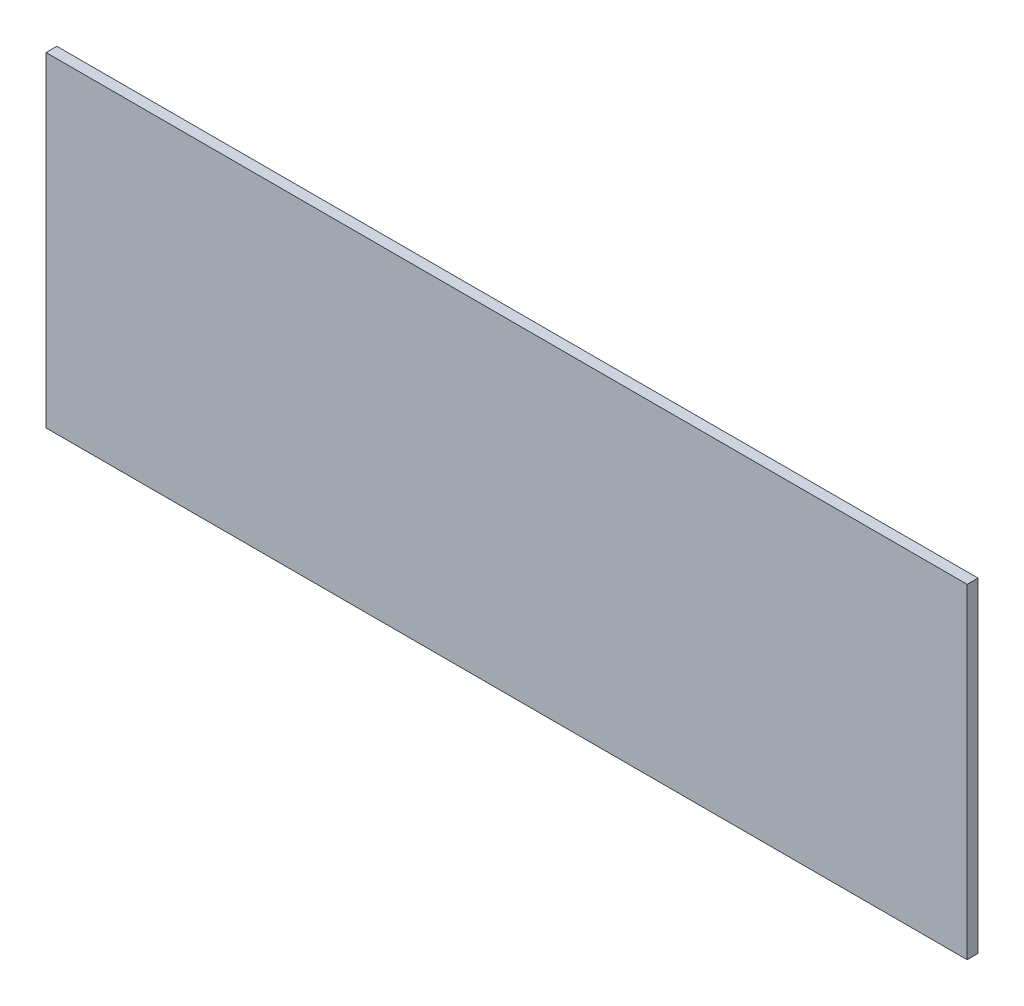
ISO-10303-21;
HEADER;
FILE_DESCRIPTION(('STEP AP214'),'2;1');
FILE_NAME('part.step','',(''),(''),'','','');
FILE_SCHEMA(('AUTOMOTIVE_DESIGN { 1 0 10303 214 1 1 1 1 }'));
ENDSEC;
DATA;
#1=APPLICATION_CONTEXT('core data for automotive mechanical design processes');
#2=APPLICATION_PROTOCOL_DEFINITION('international standard','automotive_design',2000,#1);
#3=PRODUCT_CONTEXT('',#1,'mechanical');
#4=PRODUCT('Part','Part','',(#3));
#5=PRODUCT_RELATED_PRODUCT_CATEGORY('part','',(#4));
#6=PRODUCT_DEFINITION_FORMATION('','',#4);
#7=PRODUCT_DEFINITION_CONTEXT('part definition',#1,'design');
#8=PRODUCT_DEFINITION('design','',#6,#7);
#9=PRODUCT_DEFINITION_SHAPE('','',#8);
#10=(LENGTH_UNIT() NAMED_UNIT(*) SI_UNIT(.MILLI.,.METRE.));
#11=(NAMED_UNIT(*) PLANE_ANGLE_UNIT() SI_UNIT($,.RADIAN.));
#12=(NAMED_UNIT(*) SI_UNIT($,.STERADIAN.) SOLID_ANGLE_UNIT());
#13=UNCERTAINTY_MEASURE_WITH_UNIT(LENGTH_MEASURE(1.E-05),#10,'distance_accuracy_value','');
#14=(GEOMETRIC_REPRESENTATION_CONTEXT(3) GLOBAL_UNCERTAINTY_ASSIGNED_CONTEXT((#13)) GLOBAL_UNIT_ASSIGNED_CONTEXT((#10,
#11,#12)) REPRESENTATION_CONTEXT('',''));
#15=CARTESIAN_POINT('',(0.,0.,0.));
#16=DIRECTION('',(0.,0.,1.));
#17=DIRECTION('',(1.,0.,0.));
#18=AXIS2_PLACEMENT_3D('',#15,#16,#17);
#19=CARTESIAN_POINT('',(-425.,-150.,10.));
#20=DIRECTION('',(1.,0.,0.));
#21=DIRECTION('',(0.,0.,-1.));
#22=AXIS2_PLACEMENT_3D('',#19,#20,#21);
#23=PLANE('',#22);
#24=DIRECTION('',(0.,-1.,0.));
#25=VECTOR('',#24,1.);
#26=CARTESIAN_POINT('',(-425.,-150.,0.));
#27=LINE('',#26,#25);
#28=CARTESIAN_POINT('',(-425.,150.,0.));
#29=VERTEX_POINT('',#28);
#30=CARTESIAN_POINT('',(-425.,-150.,0.));
#31=VERTEX_POINT('',#30);
#32=EDGE_CURVE('E96',#29,#31,#27,.T.);
#33=ORIENTED_EDGE('',*,*,#32,.T.);
#34=DIRECTION('',(0.,0.,-1.));
#35=VECTOR('',#34,1.);
#36=CARTESIAN_POINT('',(-425.,-150.,10.));
#37=LINE('',#36,#35);
#38=CARTESIAN_POINT('',(-425.,-150.,10.));
#39=VERTEX_POINT('',#38);
#40=EDGE_CURVE('E11',#39,#31,#37,.T.);
#41=ORIENTED_EDGE('',*,*,#40,.F.);
#42=DIRECTION('',(0.,-1.,0.));
#43=VECTOR('',#42,1.);
#44=CARTESIAN_POINT('',(-425.,-150.,10.));
#45=LINE('',#44,#43);
#46=CARTESIAN_POINT('',(-425.,150.,10.));
#47=VERTEX_POINT('',#46);
#48=EDGE_CURVE('E84',#47,#39,#45,.T.);
#49=ORIENTED_EDGE('',*,*,#48,.F.);
#50=DIRECTION('',(0.,0.,-1.));
#51=VECTOR('',#50,1.);
#52=CARTESIAN_POINT('',(-425.,150.,10.));
#53=LINE('',#52,#51);
#54=EDGE_CURVE('E92',#47,#29,#53,.T.);
#55=ORIENTED_EDGE('',*,*,#54,.T.);
#56=EDGE_LOOP('',(#33,#41,#49,#55));
#57=FACE_BOUND('',#56,.T.);
#58=ADVANCED_FACE('F33',(#57),#23,.F.);
#59=CARTESIAN_POINT('',(425.,-150.,10.));
#60=DIRECTION('',(0.,1.,0.));
#61=DIRECTION('',(-1.,0.,0.));
#62=AXIS2_PLACEMENT_3D('',#59,#60,#61);
#63=PLANE('',#62);
#64=DIRECTION('',(1.,0.,0.));
#65=VECTOR('',#64,1.);
#66=CARTESIAN_POINT('',(425.,-150.,0.));
#67=LINE('',#66,#65);
#68=CARTESIAN_POINT('',(425.,-150.,0.));
#69=VERTEX_POINT('',#68);
#70=EDGE_CURVE('E88',#31,#69,#67,.T.);
#71=ORIENTED_EDGE('',*,*,#70,.T.);
#72=DIRECTION('',(0.,0.,-1.));
#73=VECTOR('',#72,1.);
#74=CARTESIAN_POINT('',(425.,-150.,10.));
#75=LINE('',#74,#73);
#76=CARTESIAN_POINT('',(425.,-150.,10.));
#77=VERTEX_POINT('',#76);
#78=EDGE_CURVE('E41',#77,#69,#75,.T.);
#79=ORIENTED_EDGE('',*,*,#78,.F.);
#80=DIRECTION('',(1.,0.,0.));
#81=VECTOR('',#80,1.);
#82=CARTESIAN_POINT('',(425.,-150.,10.));
#83=LINE('',#82,#81);
#84=EDGE_CURVE('E79',#39,#77,#83,.T.);
#85=ORIENTED_EDGE('',*,*,#84,.F.);
#86=ORIENTED_EDGE('',*,*,#40,.T.);
#87=EDGE_LOOP('',(#71,#79,#85,#86));
#88=FACE_BOUND('',#87,.T.);
#89=ADVANCED_FACE('F87',(#88),#63,.F.);
#90=CARTESIAN_POINT('',(425.,-150.,10.));
#91=DIRECTION('',(-1.,0.,0.));
#92=DIRECTION('',(0.,0.,1.));
#93=AXIS2_PLACEMENT_3D('',#90,#91,#92);
#94=PLANE('',#93);
#95=DIRECTION('',(0.,1.,0.));
#96=VECTOR('',#95,1.);
#97=CARTESIAN_POINT('',(425.,-150.,0.));
#98=LINE('',#97,#96);
#99=CARTESIAN_POINT('',(425.,150.,0.));
#100=VERTEX_POINT('',#99);
#101=EDGE_CURVE('E66',#69,#100,#98,.T.);
#102=ORIENTED_EDGE('',*,*,#101,.T.);
#103=DIRECTION('',(0.,0.,-1.));
#104=VECTOR('',#103,1.);
#105=CARTESIAN_POINT('',(425.,150.,10.));
#106=LINE('',#105,#104);
#107=CARTESIAN_POINT('',(425.,150.,10.));
#108=VERTEX_POINT('',#107);
#109=EDGE_CURVE('E89',#108,#100,#106,.T.);
#110=ORIENTED_EDGE('',*,*,#109,.F.);
#111=DIRECTION('',(0.,1.,0.));
#112=VECTOR('',#111,1.);
#113=CARTESIAN_POINT('',(425.,-150.,10.));
#114=LINE('',#113,#112);
#115=EDGE_CURVE('E82',#77,#108,#114,.T.);
#116=ORIENTED_EDGE('',*,*,#115,.F.);
#117=ORIENTED_EDGE('',*,*,#78,.T.);
#118=EDGE_LOOP('',(#102,#110,#116,#117));
#119=FACE_BOUND('',#118,.T.);
#120=ADVANCED_FACE('F90',(#119),#94,.F.);
#121=CARTESIAN_POINT('',(425.,150.,10.));
#122=DIRECTION('',(0.,-1.,0.));
#123=DIRECTION('',(1.,0.,0.));
#124=AXIS2_PLACEMENT_3D('',#121,#122,#123);
#125=PLANE('',#124);
#126=DIRECTION('',(-1.,0.,0.));
#127=VECTOR('',#126,1.);
#128=CARTESIAN_POINT('',(425.,150.,0.));
#129=LINE('',#128,#127);
#130=EDGE_CURVE('E72',#100,#29,#129,.T.);
#131=ORIENTED_EDGE('',*,*,#130,.T.);
#132=ORIENTED_EDGE('',*,*,#54,.F.);
#133=DIRECTION('',(-1.,0.,0.));
#134=VECTOR('',#133,1.);
#135=CARTESIAN_POINT('',(425.,150.,10.));
#136=LINE('',#135,#134);
#137=EDGE_CURVE('E49',#108,#47,#136,.T.);
#138=ORIENTED_EDGE('',*,*,#137,.F.);
#139=ORIENTED_EDGE('',*,*,#109,.T.);
#140=EDGE_LOOP('',(#131,#132,#138,#139));
#141=FACE_BOUND('',#140,.T.);
#142=ADVANCED_FACE('F103',(#141),#125,.F.);
#143=CARTESIAN_POINT('',(0.,0.,10.));
#144=DIRECTION('',(0.,0.,1.));
#145=DIRECTION('',(1.,0.,0.));
#146=AXIS2_PLACEMENT_3D('',#143,#144,#145);
#147=PLANE('',#146);
#148=ORIENTED_EDGE('',*,*,#48,.T.);
#149=ORIENTED_EDGE('',*,*,#84,.T.);
#150=ORIENTED_EDGE('',*,*,#115,.T.);
#151=ORIENTED_EDGE('',*,*,#137,.T.);
#152=EDGE_LOOP('',(#148,#149,#150,#151));
#153=FACE_BOUND('',#152,.T.);
#154=ADVANCED_FACE('F80',(#153),#147,.T.);
#155=CARTESIAN_POINT('',(0.,0.,0.));
#156=DIRECTION('',(0.,0.,1.));
#157=DIRECTION('',(1.,0.,0.));
#158=AXIS2_PLACEMENT_3D('',#155,#156,#157);
#159=PLANE('',#158);
#160=ORIENTED_EDGE('',*,*,#32,.F.);
#161=ORIENTED_EDGE('',*,*,#130,.F.);
#162=ORIENTED_EDGE('',*,*,#101,.F.);
#163=ORIENTED_EDGE('',*,*,#70,.F.);
#164=EDGE_LOOP('',(#160,#161,#162,#163));
#165=FACE_BOUND('',#164,.T.);
#166=ADVANCED_FACE('F106',(#165),#159,.F.);
#167=CLOSED_SHELL('',(#58,#89,#120,#142,#154,#166));
#168=MANIFOLD_SOLID_BREP('B2',#167);
#169=ADVANCED_BREP_SHAPE_REPRESENTATION('',(#18,#168),#14);
#170=SHAPE_DEFINITION_REPRESENTATION(#9,#169);
ENDSEC;
END-ISO-10303-21;
